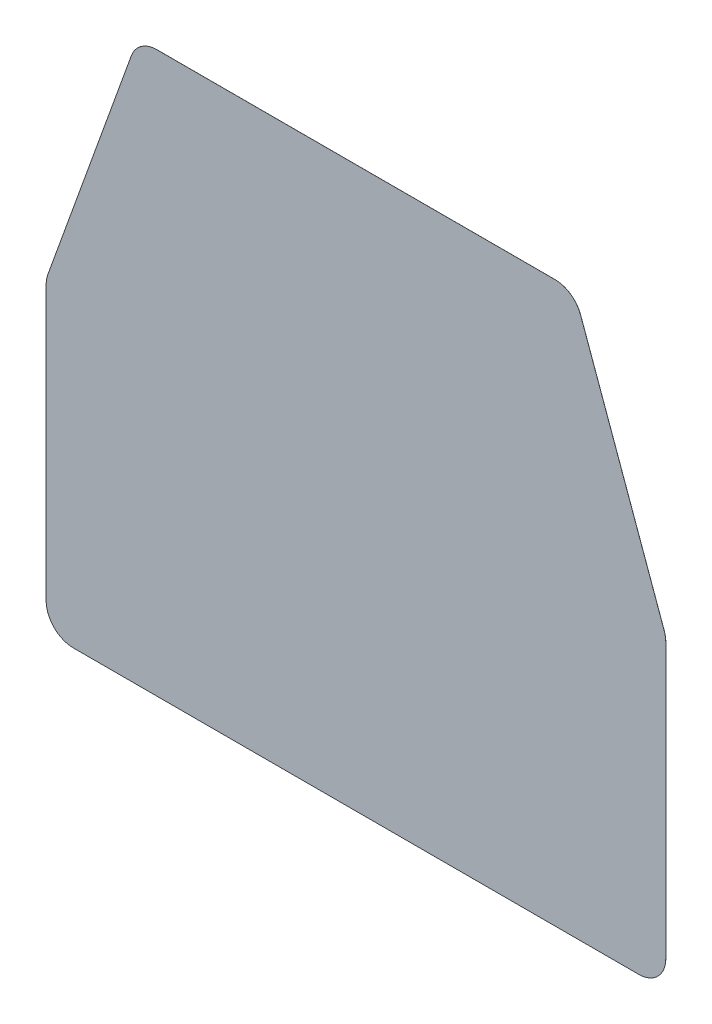
ISO-10303-21;
HEADER;
FILE_DESCRIPTION(('STEP AP214'),'2;1');
FILE_NAME('part.step','',(''),(''),'','','');
FILE_SCHEMA(('AUTOMOTIVE_DESIGN { 1 0 10303 214 1 1 1 1 }'));
ENDSEC;
DATA;
#1=APPLICATION_CONTEXT('core data for automotive mechanical design processes');
#2=APPLICATION_PROTOCOL_DEFINITION('international standard','automotive_design',2000,#1);
#3=PRODUCT_CONTEXT('',#1,'mechanical');
#4=PRODUCT('Part','Part','',(#3));
#5=PRODUCT_RELATED_PRODUCT_CATEGORY('part','',(#4));
#6=PRODUCT_DEFINITION_FORMATION('','',#4);
#7=PRODUCT_DEFINITION_CONTEXT('part definition',#1,'design');
#8=PRODUCT_DEFINITION('design','',#6,#7);
#9=PRODUCT_DEFINITION_SHAPE('','',#8);
#10=(LENGTH_UNIT() NAMED_UNIT(*) SI_UNIT(.MILLI.,.METRE.));
#11=(NAMED_UNIT(*) PLANE_ANGLE_UNIT() SI_UNIT($,.RADIAN.));
#12=(NAMED_UNIT(*) SI_UNIT($,.STERADIAN.) SOLID_ANGLE_UNIT());
#13=UNCERTAINTY_MEASURE_WITH_UNIT(LENGTH_MEASURE(1.E-05),#10,'distance_accuracy_value','');
#14=(GEOMETRIC_REPRESENTATION_CONTEXT(3) GLOBAL_UNCERTAINTY_ASSIGNED_CONTEXT((#13)) GLOBAL_UNIT_ASSIGNED_CONTEXT((#10,
#11,#12)) REPRESENTATION_CONTEXT('',''));
#15=CARTESIAN_POINT('',(0.,0.,0.));
#16=DIRECTION('',(0.,0.,1.));
#17=DIRECTION('',(1.,0.,0.));
#18=AXIS2_PLACEMENT_3D('',#15,#16,#17);
#19=CARTESIAN_POINT('',(-132.08,12.7,0.0254));
#20=DIRECTION('',(0.,0.,-1.));
#21=DIRECTION('',(-1.,0.,0.));
#22=AXIS2_PLACEMENT_3D('',#19,#20,#21);
#23=CYLINDRICAL_SURFACE('',#22,12.7);
#24=CARTESIAN_POINT('',(-132.08,12.7,0.));
#25=DIRECTION('',(0.,0.,1.));
#26=DIRECTION('',(-1.,0.,0.));
#27=AXIS2_PLACEMENT_3D('',#24,#25,#26);
#28=CIRCLE('',#27,12.7);
#29=CARTESIAN_POINT('',(-144.78,12.7,0.));
#30=VERTEX_POINT('',#29);
#31=CARTESIAN_POINT('',(-132.08,0.,0.));
#32=VERTEX_POINT('',#31);
#33=EDGE_CURVE('E153',#30,#32,#28,.T.);
#34=ORIENTED_EDGE('',*,*,#33,.T.);
#35=DIRECTION('',(0.,0.,-1.));
#36=VECTOR('',#35,1.);
#37=CARTESIAN_POINT('',(-132.08,0.,0.0254));
#38=LINE('',#37,#36);
#39=CARTESIAN_POINT('',(-132.08,0.,0.0254));
#40=VERTEX_POINT('',#39);
#41=EDGE_CURVE('E11',#40,#32,#38,.T.);
#42=ORIENTED_EDGE('',*,*,#41,.F.);
#43=CARTESIAN_POINT('',(-132.08,12.7,0.0254));
#44=DIRECTION('',(0.,0.,1.));
#45=DIRECTION('',(-1.,0.,0.));
#46=AXIS2_PLACEMENT_3D('',#43,#44,#45);
#47=CIRCLE('',#46,12.7);
#48=CARTESIAN_POINT('',(-144.78,12.7,0.0254));
#49=VERTEX_POINT('',#48);
#50=EDGE_CURVE('E175',#49,#40,#47,.T.);
#51=ORIENTED_EDGE('',*,*,#50,.F.);
#52=DIRECTION('',(0.,0.,-1.));
#53=VECTOR('',#52,1.);
#54=CARTESIAN_POINT('',(-144.78,12.7,0.0254));
#55=LINE('',#54,#53);
#56=EDGE_CURVE('E149',#49,#30,#55,.T.);
#57=ORIENTED_EDGE('',*,*,#56,.T.);
#58=EDGE_LOOP('',(#34,#42,#51,#57));
#59=FACE_BOUND('',#58,.T.);
#60=ADVANCED_FACE('F33',(#59),#23,.T.);
#61=CARTESIAN_POINT('',(-132.08,0.,0.0254));
#62=DIRECTION('',(0.,1.,0.));
#63=DIRECTION('',(0.,0.,1.));
#64=AXIS2_PLACEMENT_3D('',#61,#62,#63);
#65=PLANE('',#64);
#66=DIRECTION('',(1.,0.,0.));
#67=VECTOR('',#66,1.);
#68=CARTESIAN_POINT('',(-132.08,0.,0.));
#69=LINE('',#68,#67);
#70=CARTESIAN_POINT('',(132.08,0.,0.));
#71=VERTEX_POINT('',#70);
#72=EDGE_CURVE('E156',#32,#71,#69,.T.);
#73=ORIENTED_EDGE('',*,*,#72,.T.);
#74=DIRECTION('',(0.,0.,-1.));
#75=VECTOR('',#74,1.);
#76=CARTESIAN_POINT('',(132.08,0.,0.0254));
#77=LINE('',#76,#75);
#78=CARTESIAN_POINT('',(132.08,0.,0.0254));
#79=VERTEX_POINT('',#78);
#80=EDGE_CURVE('E41',#79,#71,#77,.T.);
#81=ORIENTED_EDGE('',*,*,#80,.F.);
#82=DIRECTION('',(1.,0.,0.));
#83=VECTOR('',#82,1.);
#84=CARTESIAN_POINT('',(-132.08,0.,0.0254));
#85=LINE('',#84,#83);
#86=EDGE_CURVE('E104',#40,#79,#85,.T.);
#87=ORIENTED_EDGE('',*,*,#86,.F.);
#88=ORIENTED_EDGE('',*,*,#41,.T.);
#89=EDGE_LOOP('',(#73,#81,#87,#88));
#90=FACE_BOUND('',#89,.T.);
#91=ADVANCED_FACE('F253',(#90),#65,.F.);
#92=CARTESIAN_POINT('',(132.08,12.7,0.0254));
#93=DIRECTION('',(0.,0.,-1.));
#94=DIRECTION('',(-1.,0.,0.));
#95=AXIS2_PLACEMENT_3D('',#92,#93,#94);
#96=CYLINDRICAL_SURFACE('',#95,12.7);
#97=CARTESIAN_POINT('',(132.08,12.7,0.));
#98=DIRECTION('',(0.,0.,1.));
#99=DIRECTION('',(-1.,0.,0.));
#100=AXIS2_PLACEMENT_3D('',#97,#98,#99);
#101=CIRCLE('',#100,12.7);
#102=CARTESIAN_POINT('',(144.78,12.7,0.));
#103=VERTEX_POINT('',#102);
#104=EDGE_CURVE('E158',#71,#103,#101,.T.);
#105=ORIENTED_EDGE('',*,*,#104,.T.);
#106=DIRECTION('',(0.,0.,-1.));
#107=VECTOR('',#106,1.);
#108=CARTESIAN_POINT('',(144.78,12.7,0.0254));
#109=LINE('',#108,#107);
#110=CARTESIAN_POINT('',(144.78,12.7,0.0254));
#111=VERTEX_POINT('',#110);
#112=EDGE_CURVE('E194',#111,#103,#109,.T.);
#113=ORIENTED_EDGE('',*,*,#112,.F.);
#114=CARTESIAN_POINT('',(132.08,12.7,0.0254));
#115=DIRECTION('',(0.,0.,1.));
#116=DIRECTION('',(-1.,0.,0.));
#117=AXIS2_PLACEMENT_3D('',#114,#115,#116);
#118=CIRCLE('',#117,12.7);
#119=EDGE_CURVE('E202',#79,#111,#118,.T.);
#120=ORIENTED_EDGE('',*,*,#119,.F.);
#121=ORIENTED_EDGE('',*,*,#80,.T.);
#122=EDGE_LOOP('',(#105,#113,#120,#121));
#123=FACE_BOUND('',#122,.T.);
#124=ADVANCED_FACE('F200',(#123),#96,.T.);
#125=CARTESIAN_POINT('',(144.78,140.779102187646,0.0254));
#126=DIRECTION('',(-1.,0.,0.));
#127=DIRECTION('',(0.,-1.,0.));
#128=AXIS2_PLACEMENT_3D('',#125,#126,#127);
#129=PLANE('',#128);
#130=DIRECTION('',(0.,1.,0.));
#131=VECTOR('',#130,1.);
#132=CARTESIAN_POINT('',(144.78,140.779102187646,0.));
#133=LINE('',#132,#131);
#134=CARTESIAN_POINT('',(144.78,140.779102187646,0.));
#135=VERTEX_POINT('',#134);
#136=EDGE_CURVE('E160',#103,#135,#133,.T.);
#137=ORIENTED_EDGE('',*,*,#136,.T.);
#138=DIRECTION('',(0.,0.,-1.));
#139=VECTOR('',#138,1.);
#140=CARTESIAN_POINT('',(144.78,140.779102187646,0.0254));
#141=LINE('',#140,#139);
#142=CARTESIAN_POINT('',(144.78,140.779102187646,0.0254));
#143=VERTEX_POINT('',#142);
#144=EDGE_CURVE('E191',#143,#135,#141,.T.);
#145=ORIENTED_EDGE('',*,*,#144,.F.);
#146=DIRECTION('',(0.,1.,0.));
#147=VECTOR('',#146,1.);
#148=CARTESIAN_POINT('',(144.78,140.779102187646,0.0254));
#149=LINE('',#148,#147);
#150=EDGE_CURVE('E220',#111,#143,#149,.T.);
#151=ORIENTED_EDGE('',*,*,#150,.F.);
#152=ORIENTED_EDGE('',*,*,#112,.T.);
#153=EDGE_LOOP('',(#137,#145,#151,#152));
#154=FACE_BOUND('',#153,.T.);
#155=ADVANCED_FACE('F211',(#154),#129,.F.);
#156=CARTESIAN_POINT('',(132.08,140.779102187646,0.0254));
#157=DIRECTION('',(0.,0.,-1.));
#158=DIRECTION('',(-1.,0.,0.));
#159=AXIS2_PLACEMENT_3D('',#156,#157,#158);
#160=CYLINDRICAL_SURFACE('',#159,12.7);
#161=CARTESIAN_POINT('',(132.08,140.779102187646,0.));
#162=DIRECTION('',(0.,0.,1.));
#163=DIRECTION('',(-1.,0.,0.));
#164=AXIS2_PLACEMENT_3D('',#161,#162,#163);
#165=CIRCLE('',#164,12.7);
#166=CARTESIAN_POINT('',(144.024977353291,145.092745198996,0.));
#167=VERTEX_POINT('',#166);
#168=EDGE_CURVE('E162',#135,#167,#165,.T.);
#169=ORIENTED_EDGE('',*,*,#168,.T.);
#170=DIRECTION('',(0.,0.,-1.));
#171=VECTOR('',#170,1.);
#172=CARTESIAN_POINT('',(144.024977353291,145.092745198996,0.0254));
#173=LINE('',#172,#171);
#174=CARTESIAN_POINT('',(144.024977353291,145.092745198996,0.0254));
#175=VERTEX_POINT('',#174);
#176=EDGE_CURVE('E188',#175,#167,#173,.T.);
#177=ORIENTED_EDGE('',*,*,#176,.F.);
#178=CARTESIAN_POINT('',(132.08,140.779102187646,0.0254));
#179=DIRECTION('',(0.,0.,1.));
#180=DIRECTION('',(-1.,0.,0.));
#181=AXIS2_PLACEMENT_3D('',#178,#179,#180);
#182=CIRCLE('',#181,12.7);
#183=EDGE_CURVE('E217',#143,#175,#182,.T.);
#184=ORIENTED_EDGE('',*,*,#183,.F.);
#185=ORIENTED_EDGE('',*,*,#144,.T.);
#186=EDGE_LOOP('',(#169,#177,#184,#185));
#187=FACE_BOUND('',#186,.T.);
#188=ADVANCED_FACE('F215',(#187),#160,.T.);
#189=CARTESIAN_POINT('',(104.972477353291,253.23364301135,0.0254));
#190=DIRECTION('',(-0.940549397896914,-0.339656930027569,0.));
#191=DIRECTION('',(0.339656930027569,-0.940549397896914,0.));
#192=AXIS2_PLACEMENT_3D('',#189,#190,#191);
#193=PLANE('',#192);
#194=DIRECTION('',(-0.339656930027569,0.940549397896914,0.));
#195=VECTOR('',#194,1.);
#196=CARTESIAN_POINT('',(104.972477353291,253.23364301135,0.));
#197=LINE('',#196,#195);
#198=CARTESIAN_POINT('',(104.972477353291,253.23364301135,0.));
#199=VERTEX_POINT('',#198);
#200=EDGE_CURVE('E164',#167,#199,#197,.T.);
#201=ORIENTED_EDGE('',*,*,#200,.T.);
#202=DIRECTION('',(0.,0.,-1.));
#203=VECTOR('',#202,1.);
#204=CARTESIAN_POINT('',(104.972477353291,253.23364301135,0.0254));
#205=LINE('',#204,#203);
#206=CARTESIAN_POINT('',(104.972477353291,253.23364301135,0.0254));
#207=VERTEX_POINT('',#206);
#208=EDGE_CURVE('E185',#207,#199,#205,.T.);
#209=ORIENTED_EDGE('',*,*,#208,.F.);
#210=DIRECTION('',(-0.339656930027569,0.940549397896914,0.));
#211=VECTOR('',#210,1.);
#212=CARTESIAN_POINT('',(104.972477353291,253.23364301135,0.0254));
#213=LINE('',#212,#211);
#214=EDGE_CURVE('E219',#175,#207,#213,.T.);
#215=ORIENTED_EDGE('',*,*,#214,.F.);
#216=ORIENTED_EDGE('',*,*,#176,.T.);
#217=EDGE_LOOP('',(#201,#209,#215,#216));
#218=FACE_BOUND('',#217,.T.);
#219=ADVANCED_FACE('F266',(#218),#193,.F.);
#220=CARTESIAN_POINT('',(93.0275,248.92,0.0254));
#221=DIRECTION('',(0.,0.,-1.));
#222=DIRECTION('',(-1.,0.,0.));
#223=AXIS2_PLACEMENT_3D('',#220,#221,#222);
#224=CYLINDRICAL_SURFACE('',#223,12.7);
#225=CARTESIAN_POINT('',(93.0275,248.92,0.));
#226=DIRECTION('',(0.,0.,1.));
#227=DIRECTION('',(1.,0.,0.));
#228=AXIS2_PLACEMENT_3D('',#225,#226,#227);
#229=CIRCLE('',#228,12.7);
#230=CARTESIAN_POINT('',(93.0275,261.62,0.));
#231=VERTEX_POINT('',#230);
#232=EDGE_CURVE('E166',#199,#231,#229,.T.);
#233=ORIENTED_EDGE('',*,*,#232,.T.);
#234=DIRECTION('',(0.,0.,-1.));
#235=VECTOR('',#234,1.);
#236=CARTESIAN_POINT('',(93.0275,261.62,0.0254));
#237=LINE('',#236,#235);
#238=CARTESIAN_POINT('',(93.0275,261.62,0.0254));
#239=VERTEX_POINT('',#238);
#240=EDGE_CURVE('E182',#239,#231,#237,.T.);
#241=ORIENTED_EDGE('',*,*,#240,.F.);
#242=CARTESIAN_POINT('',(93.0275,248.92,0.0254));
#243=DIRECTION('',(0.,0.,1.));
#244=DIRECTION('',(1.,0.,0.));
#245=AXIS2_PLACEMENT_3D('',#242,#243,#244);
#246=CIRCLE('',#245,12.7);
#247=EDGE_CURVE('E222',#207,#239,#246,.T.);
#248=ORIENTED_EDGE('',*,*,#247,.F.);
#249=ORIENTED_EDGE('',*,*,#208,.T.);
#250=EDGE_LOOP('',(#233,#241,#248,#249));
#251=FACE_BOUND('',#250,.T.);
#252=ADVANCED_FACE('F269',(#251),#224,.T.);
#253=CARTESIAN_POINT('',(93.0275,261.62,0.0254));
#254=DIRECTION('',(0.,-1.,0.));
#255=DIRECTION('',(0.,0.,-1.));
#256=AXIS2_PLACEMENT_3D('',#253,#254,#255);
#257=PLANE('',#256);
#258=DIRECTION('',(-1.,0.,0.));
#259=VECTOR('',#258,1.);
#260=CARTESIAN_POINT('',(93.0275,261.62,0.));
#261=LINE('',#260,#259);
#262=CARTESIAN_POINT('',(-93.0275,261.62,0.));
#263=VERTEX_POINT('',#262);
#264=EDGE_CURVE('E168',#231,#263,#261,.T.);
#265=ORIENTED_EDGE('',*,*,#264,.T.);
#266=DIRECTION('',(0.,0.,-1.));
#267=VECTOR('',#266,1.);
#268=CARTESIAN_POINT('',(-93.0275,261.62,0.0254));
#269=LINE('',#268,#267);
#270=CARTESIAN_POINT('',(-93.0275,261.62,0.0254));
#271=VERTEX_POINT('',#270);
#272=EDGE_CURVE('E179',#271,#263,#269,.T.);
#273=ORIENTED_EDGE('',*,*,#272,.F.);
#274=DIRECTION('',(-1.,0.,0.));
#275=VECTOR('',#274,1.);
#276=CARTESIAN_POINT('',(93.0275,261.62,0.0254));
#277=LINE('',#276,#275);
#278=EDGE_CURVE('E228',#239,#271,#277,.T.);
#279=ORIENTED_EDGE('',*,*,#278,.F.);
#280=ORIENTED_EDGE('',*,*,#240,.T.);
#281=EDGE_LOOP('',(#265,#273,#279,#280));
#282=FACE_BOUND('',#281,.T.);
#283=ADVANCED_FACE('F234',(#282),#257,.F.);
#284=CARTESIAN_POINT('',(-93.0275,248.92,0.0254));
#285=DIRECTION('',(0.,0.,-1.));
#286=DIRECTION('',(-1.,0.,0.));
#287=AXIS2_PLACEMENT_3D('',#284,#285,#286);
#288=CYLINDRICAL_SURFACE('',#287,12.7);
#289=CARTESIAN_POINT('',(-93.0275,248.92,0.));
#290=DIRECTION('',(0.,0.,1.));
#291=DIRECTION('',(1.,0.,0.));
#292=AXIS2_PLACEMENT_3D('',#289,#290,#291);
#293=CIRCLE('',#292,12.7);
#294=CARTESIAN_POINT('',(-104.972477353291,253.23364301135,0.));
#295=VERTEX_POINT('',#294);
#296=EDGE_CURVE('E170',#263,#295,#293,.T.);
#297=ORIENTED_EDGE('',*,*,#296,.T.);
#298=DIRECTION('',(0.,0.,-1.));
#299=VECTOR('',#298,1.);
#300=CARTESIAN_POINT('',(-104.972477353291,253.23364301135,0.0254));
#301=LINE('',#300,#299);
#302=CARTESIAN_POINT('',(-104.972477353291,253.23364301135,0.0254));
#303=VERTEX_POINT('',#302);
#304=EDGE_CURVE('E144',#303,#295,#301,.T.);
#305=ORIENTED_EDGE('',*,*,#304,.F.);
#306=CARTESIAN_POINT('',(-93.0275,248.92,0.0254));
#307=DIRECTION('',(0.,0.,1.));
#308=DIRECTION('',(1.,0.,0.));
#309=AXIS2_PLACEMENT_3D('',#306,#307,#308);
#310=CIRCLE('',#309,12.7);
#311=EDGE_CURVE('E135',#271,#303,#310,.T.);
#312=ORIENTED_EDGE('',*,*,#311,.F.);
#313=ORIENTED_EDGE('',*,*,#272,.T.);
#314=EDGE_LOOP('',(#297,#305,#312,#313));
#315=FACE_BOUND('',#314,.T.);
#316=ADVANCED_FACE('F238',(#315),#288,.T.);
#317=CARTESIAN_POINT('',(-104.972477353291,253.23364301135,0.0254));
#318=DIRECTION('',(0.940549397896914,-0.339656930027569,0.));
#319=DIRECTION('',(0.339656930027569,0.940549397896914,0.));
#320=AXIS2_PLACEMENT_3D('',#317,#318,#319);
#321=PLANE('',#320);
#322=DIRECTION('',(-0.339656930027569,-0.940549397896914,0.));
#323=VECTOR('',#322,1.);
#324=CARTESIAN_POINT('',(-104.972477353291,253.23364301135,0.));
#325=LINE('',#324,#323);
#326=CARTESIAN_POINT('',(-144.024977353291,145.092745198996,0.));
#327=VERTEX_POINT('',#326);
#328=EDGE_CURVE('E143',#295,#327,#325,.T.);
#329=ORIENTED_EDGE('',*,*,#328,.T.);
#330=DIRECTION('',(0.,0.,-1.));
#331=VECTOR('',#330,1.);
#332=CARTESIAN_POINT('',(-144.024977353291,145.092745198996,0.0254));
#333=LINE('',#332,#331);
#334=CARTESIAN_POINT('',(-144.024977353291,145.092745198996,0.0254));
#335=VERTEX_POINT('',#334);
#336=EDGE_CURVE('E140',#335,#327,#333,.T.);
#337=ORIENTED_EDGE('',*,*,#336,.F.);
#338=DIRECTION('',(-0.339656930027569,-0.940549397896914,0.));
#339=VECTOR('',#338,1.);
#340=CARTESIAN_POINT('',(-104.972477353291,253.23364301135,0.0254));
#341=LINE('',#340,#339);
#342=EDGE_CURVE('E129',#303,#335,#341,.T.);
#343=ORIENTED_EDGE('',*,*,#342,.F.);
#344=ORIENTED_EDGE('',*,*,#304,.T.);
#345=EDGE_LOOP('',(#329,#337,#343,#344));
#346=FACE_BOUND('',#345,.T.);
#347=ADVANCED_FACE('F141',(#346),#321,.F.);
#348=CARTESIAN_POINT('',(-132.08,140.779102187646,0.0254));
#349=DIRECTION('',(0.,0.,-1.));
#350=DIRECTION('',(-1.,0.,0.));
#351=AXIS2_PLACEMENT_3D('',#348,#349,#350);
#352=CYLINDRICAL_SURFACE('',#351,12.7);
#353=CARTESIAN_POINT('',(-132.08,140.779102187646,0.));
#354=DIRECTION('',(0.,0.,1.));
#355=DIRECTION('',(1.,0.,0.));
#356=AXIS2_PLACEMENT_3D('',#353,#354,#355);
#357=CIRCLE('',#356,12.7);
#358=CARTESIAN_POINT('',(-144.78,140.779102187646,0.));
#359=VERTEX_POINT('',#358);
#360=EDGE_CURVE('E90',#327,#359,#357,.T.);
#361=ORIENTED_EDGE('',*,*,#360,.T.);
#362=DIRECTION('',(0.,0.,-1.));
#363=VECTOR('',#362,1.);
#364=CARTESIAN_POINT('',(-144.78,140.779102187646,0.0254));
#365=LINE('',#364,#363);
#366=CARTESIAN_POINT('',(-144.78,140.779102187646,0.0254));
#367=VERTEX_POINT('',#366);
#368=EDGE_CURVE('E145',#367,#359,#365,.T.);
#369=ORIENTED_EDGE('',*,*,#368,.F.);
#370=CARTESIAN_POINT('',(-132.08,140.779102187646,0.0254));
#371=DIRECTION('',(0.,0.,1.));
#372=DIRECTION('',(1.,0.,0.));
#373=AXIS2_PLACEMENT_3D('',#370,#371,#372);
#374=CIRCLE('',#373,12.7);
#375=EDGE_CURVE('E133',#335,#367,#374,.T.);
#376=ORIENTED_EDGE('',*,*,#375,.F.);
#377=ORIENTED_EDGE('',*,*,#336,.T.);
#378=EDGE_LOOP('',(#361,#369,#376,#377));
#379=FACE_BOUND('',#378,.T.);
#380=ADVANCED_FACE('F147',(#379),#352,.T.);
#381=CARTESIAN_POINT('',(-144.78,140.779102187646,0.0254));
#382=DIRECTION('',(1.,0.,0.));
#383=DIRECTION('',(0.,1.,0.));
#384=AXIS2_PLACEMENT_3D('',#381,#382,#383);
#385=PLANE('',#384);
#386=DIRECTION('',(0.,-1.,0.));
#387=VECTOR('',#386,1.);
#388=CARTESIAN_POINT('',(-144.78,140.779102187646,0.));
#389=LINE('',#388,#387);
#390=EDGE_CURVE('E96',#359,#30,#389,.T.);
#391=ORIENTED_EDGE('',*,*,#390,.T.);
#392=ORIENTED_EDGE('',*,*,#56,.F.);
#393=DIRECTION('',(0.,-1.,0.));
#394=VECTOR('',#393,1.);
#395=CARTESIAN_POINT('',(-144.78,140.779102187646,0.0254));
#396=LINE('',#395,#394);
#397=EDGE_CURVE('E49',#367,#49,#396,.T.);
#398=ORIENTED_EDGE('',*,*,#397,.F.);
#399=ORIENTED_EDGE('',*,*,#368,.T.);
#400=EDGE_LOOP('',(#391,#392,#398,#399));
#401=FACE_BOUND('',#400,.T.);
#402=ADVANCED_FACE('F242',(#401),#385,.F.);
#403=CARTESIAN_POINT('',(-132.08,12.7,0.0254));
#404=DIRECTION('',(0.,0.,-1.));
#405=DIRECTION('',(-1.,0.,0.));
#406=AXIS2_PLACEMENT_3D('',#403,#404,#405);
#407=PLANE('',#406);
#408=ORIENTED_EDGE('',*,*,#50,.T.);
#409=ORIENTED_EDGE('',*,*,#86,.T.);
#410=ORIENTED_EDGE('',*,*,#119,.T.);
#411=ORIENTED_EDGE('',*,*,#150,.T.);
#412=ORIENTED_EDGE('',*,*,#183,.T.);
#413=ORIENTED_EDGE('',*,*,#214,.T.);
#414=ORIENTED_EDGE('',*,*,#247,.T.);
#415=ORIENTED_EDGE('',*,*,#278,.T.);
#416=ORIENTED_EDGE('',*,*,#311,.T.);
#417=ORIENTED_EDGE('',*,*,#342,.T.);
#418=ORIENTED_EDGE('',*,*,#375,.T.);
#419=ORIENTED_EDGE('',*,*,#397,.T.);
#420=EDGE_LOOP('',(#408,#409,#410,#411,#412,#413,#414,#415,#416,#417,#418,#419));
#421=FACE_BOUND('',#420,.T.);
#422=ADVANCED_FACE('F131',(#421),#407,.F.);
#423=CARTESIAN_POINT('',(-132.08,12.7,0.));
#424=DIRECTION('',(0.,0.,-1.));
#425=DIRECTION('',(-1.,0.,0.));
#426=AXIS2_PLACEMENT_3D('',#423,#424,#425);
#427=PLANE('',#426);
#428=ORIENTED_EDGE('',*,*,#33,.F.);
#429=ORIENTED_EDGE('',*,*,#390,.F.);
#430=ORIENTED_EDGE('',*,*,#360,.F.);
#431=ORIENTED_EDGE('',*,*,#328,.F.);
#432=ORIENTED_EDGE('',*,*,#296,.F.);
#433=ORIENTED_EDGE('',*,*,#264,.F.);
#434=ORIENTED_EDGE('',*,*,#232,.F.);
#435=ORIENTED_EDGE('',*,*,#200,.F.);
#436=ORIENTED_EDGE('',*,*,#168,.F.);
#437=ORIENTED_EDGE('',*,*,#136,.F.);
#438=ORIENTED_EDGE('',*,*,#104,.F.);
#439=ORIENTED_EDGE('',*,*,#72,.F.);
#440=EDGE_LOOP('',(#428,#429,#430,#431,#432,#433,#434,#435,#436,#437,#438,#439));
#441=FACE_BOUND('',#440,.T.);
#442=ADVANCED_FACE('F206',(#441),#427,.T.);
#443=CLOSED_SHELL('',(#60,#91,#124,#155,#188,#219,#252,#283,#316,#347,#380,#402,#422,#442));
#444=MANIFOLD_SOLID_BREP('B2',#443);
#445=ADVANCED_BREP_SHAPE_REPRESENTATION('',(#18,#444),#14);
#446=SHAPE_DEFINITION_REPRESENTATION(#9,#445);
ENDSEC;
END-ISO-10303-21;
